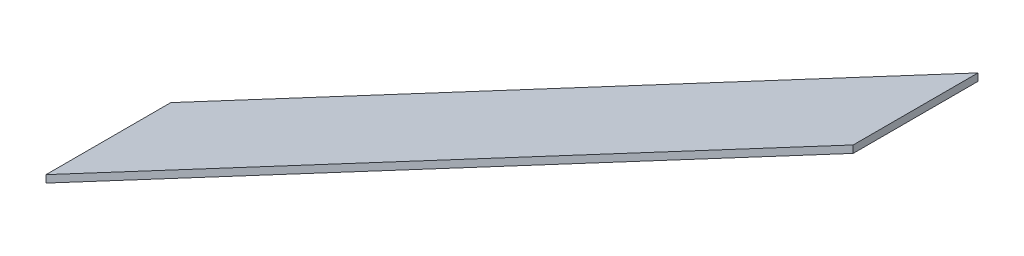
ISO-10303-21;
HEADER;
FILE_DESCRIPTION(('STEP AP214'),'2;1');
FILE_NAME('part.step','',(''),(''),'','','');
FILE_SCHEMA(('AUTOMOTIVE_DESIGN { 1 0 10303 214 1 1 1 1 }'));
ENDSEC;
DATA;
#1=APPLICATION_CONTEXT('core data for automotive mechanical design processes');
#2=APPLICATION_PROTOCOL_DEFINITION('international standard','automotive_design',2000,#1);
#3=PRODUCT_CONTEXT('',#1,'mechanical');
#4=PRODUCT('Part','Part','',(#3));
#5=PRODUCT_RELATED_PRODUCT_CATEGORY('part','',(#4));
#6=PRODUCT_DEFINITION_FORMATION('','',#4);
#7=PRODUCT_DEFINITION_CONTEXT('part definition',#1,'design');
#8=PRODUCT_DEFINITION('design','',#6,#7);
#9=PRODUCT_DEFINITION_SHAPE('','',#8);
#10=(LENGTH_UNIT() NAMED_UNIT(*) SI_UNIT(.MILLI.,.METRE.));
#11=(NAMED_UNIT(*) PLANE_ANGLE_UNIT() SI_UNIT($,.RADIAN.));
#12=(NAMED_UNIT(*) SI_UNIT($,.STERADIAN.) SOLID_ANGLE_UNIT());
#13=UNCERTAINTY_MEASURE_WITH_UNIT(LENGTH_MEASURE(1.E-05),#10,'distance_accuracy_value','');
#14=(GEOMETRIC_REPRESENTATION_CONTEXT(3) GLOBAL_UNCERTAINTY_ASSIGNED_CONTEXT((#13)) GLOBAL_UNIT_ASSIGNED_CONTEXT((#10,
#11,#12)) REPRESENTATION_CONTEXT('',''));
#15=CARTESIAN_POINT('',(0.,0.,0.));
#16=DIRECTION('',(0.,0.,1.));
#17=DIRECTION('',(1.,0.,0.));
#18=AXIS2_PLACEMENT_3D('',#15,#16,#17);
#19=CARTESIAN_POINT('',(-1000.,-49.9999999999998,-850.000000000001));
#20=DIRECTION('',(1.,0.,0.));
#21=DIRECTION('',(0.,0.,-1.));
#22=AXIS2_PLACEMENT_3D('',#19,#20,#21);
#23=PLANE('',#22);
#24=DIRECTION('',(0.,1.,0.));
#25=VECTOR('',#24,1.);
#26=CARTESIAN_POINT('',(-1000.,-49.9999999999998,0.));
#27=LINE('',#26,#25);
#28=CARTESIAN_POINT('',(-1000.,-49.9999999999998,0.));
#29=VERTEX_POINT('',#28);
#30=CARTESIAN_POINT('',(-1000.,0.,0.));
#31=VERTEX_POINT('',#30);
#32=EDGE_CURVE('E94',#29,#31,#27,.T.);
#33=ORIENTED_EDGE('',*,*,#32,.F.);
#34=DIRECTION('',(0.,0.,1.));
#35=VECTOR('',#34,1.);
#36=CARTESIAN_POINT('',(-1000.,-49.9999999999998,-850.000000000001));
#37=LINE('',#36,#35);
#38=CARTESIAN_POINT('',(-1000.,-49.9999999999998,-850.000000000001));
#39=VERTEX_POINT('',#38);
#40=EDGE_CURVE('E11',#39,#29,#37,.T.);
#41=ORIENTED_EDGE('',*,*,#40,.F.);
#42=DIRECTION('',(0.,1.,0.));
#43=VECTOR('',#42,1.);
#44=CARTESIAN_POINT('',(-1000.,-49.9999999999998,-850.000000000001));
#45=LINE('',#44,#43);
#46=CARTESIAN_POINT('',(-1000.,0.,-850.000000000001));
#47=VERTEX_POINT('',#46);
#48=EDGE_CURVE('E88',#39,#47,#45,.T.);
#49=ORIENTED_EDGE('',*,*,#48,.T.);
#50=DIRECTION('',(0.,0.,1.));
#51=VECTOR('',#50,1.);
#52=CARTESIAN_POINT('',(-1000.,0.,-850.000000000001));
#53=LINE('',#52,#51);
#54=EDGE_CURVE('E33',#47,#31,#53,.T.);
#55=ORIENTED_EDGE('',*,*,#54,.T.);
#56=EDGE_LOOP('',(#33,#41,#49,#55));
#57=FACE_BOUND('',#56,.T.);
#58=ADVANCED_FACE('F30',(#57),#23,.T.);
#59=CARTESIAN_POINT('',(-1000.,-49.9999999999998,-850.000000000001));
#60=DIRECTION('',(0.469583150901357,-0.88288825136002,0.));
#61=DIRECTION('',(0.88288825136002,0.469583150901357,0.));
#62=AXIS2_PLACEMENT_3D('',#59,#60,#61);
#63=PLANE('',#62);
#64=DIRECTION('',(0.88288825136002,0.469583150901357,0.));
#65=VECTOR('',#64,1.);
#66=CARTESIAN_POINT('',(-1000.,-49.9999999999998,0.));
#67=LINE('',#66,#65);
#68=CARTESIAN_POINT('',(-6499.44803230502,-2975.,-3.5527136788005E-12));
#69=VERTEX_POINT('',#68);
#70=EDGE_CURVE('E90',#69,#29,#67,.T.);
#71=ORIENTED_EDGE('',*,*,#70,.F.);
#72=DIRECTION('',(0.,0.,1.));
#73=VECTOR('',#72,1.);
#74=CARTESIAN_POINT('',(-6499.44803230502,-2975.,-849.999999999998));
#75=LINE('',#74,#73);
#76=CARTESIAN_POINT('',(-6499.44803230502,-2975.,-849.999999999998));
#77=VERTEX_POINT('',#76);
#78=EDGE_CURVE('E39',#77,#69,#75,.T.);
#79=ORIENTED_EDGE('',*,*,#78,.F.);
#80=DIRECTION('',(0.88288825136002,0.469583150901357,0.));
#81=VECTOR('',#80,1.);
#82=CARTESIAN_POINT('',(-1000.,-49.9999999999998,-850.000000000001));
#83=LINE('',#82,#81);
#84=EDGE_CURVE('E85',#77,#39,#83,.T.);
#85=ORIENTED_EDGE('',*,*,#84,.T.);
#86=ORIENTED_EDGE('',*,*,#40,.T.);
#87=EDGE_LOOP('',(#71,#79,#85,#86));
#88=FACE_BOUND('',#87,.T.);
#89=ADVANCED_FACE('F104',(#88),#63,.T.);
#90=CARTESIAN_POINT('',(-6499.44803230502,-2925.,-849.999999999998));
#91=DIRECTION('',(-1.,0.,0.));
#92=DIRECTION('',(0.,0.,1.));
#93=AXIS2_PLACEMENT_3D('',#90,#91,#92);
#94=PLANE('',#93);
#95=DIRECTION('',(0.,-1.,0.));
#96=VECTOR('',#95,1.);
#97=CARTESIAN_POINT('',(-6499.44803230502,-2925.,-3.5527136788005E-12));
#98=LINE('',#97,#96);
#99=CARTESIAN_POINT('',(-6499.44803230502,-2925.,-3.5527136788005E-12));
#100=VERTEX_POINT('',#99);
#101=EDGE_CURVE('E80',#100,#69,#98,.T.);
#102=ORIENTED_EDGE('',*,*,#101,.F.);
#103=DIRECTION('',(0.,0.,1.));
#104=VECTOR('',#103,1.);
#105=CARTESIAN_POINT('',(-6499.44803230502,-2925.,-849.999999999998));
#106=LINE('',#105,#104);
#107=CARTESIAN_POINT('',(-6499.44803230502,-2925.,-849.999999999998));
#108=VERTEX_POINT('',#107);
#109=EDGE_CURVE('E75',#108,#100,#106,.T.);
#110=ORIENTED_EDGE('',*,*,#109,.F.);
#111=DIRECTION('',(0.,-1.,0.));
#112=VECTOR('',#111,1.);
#113=CARTESIAN_POINT('',(-6499.44803230502,-2925.,-849.999999999998));
#114=LINE('',#113,#112);
#115=EDGE_CURVE('E78',#108,#77,#114,.T.);
#116=ORIENTED_EDGE('',*,*,#115,.T.);
#117=ORIENTED_EDGE('',*,*,#78,.T.);
#118=EDGE_LOOP('',(#102,#110,#116,#117));
#119=FACE_BOUND('',#118,.T.);
#120=ADVANCED_FACE('F77',(#119),#94,.T.);
#121=CARTESIAN_POINT('',(-1000.,0.,-850.000000000001));
#122=DIRECTION('',(-0.469583150901357,0.88288825136002,0.));
#123=DIRECTION('',(-0.88288825136002,-0.469583150901357,0.));
#124=AXIS2_PLACEMENT_3D('',#121,#122,#123);
#125=PLANE('',#124);
#126=DIRECTION('',(-0.88288825136002,-0.469583150901357,0.));
#127=VECTOR('',#126,1.);
#128=CARTESIAN_POINT('',(-1000.,0.,0.));
#129=LINE('',#128,#127);
#130=EDGE_CURVE('E97',#31,#100,#129,.T.);
#131=ORIENTED_EDGE('',*,*,#130,.F.);
#132=ORIENTED_EDGE('',*,*,#54,.F.);
#133=DIRECTION('',(-0.88288825136002,-0.469583150901357,0.));
#134=VECTOR('',#133,1.);
#135=CARTESIAN_POINT('',(-1000.,0.,-850.000000000001));
#136=LINE('',#135,#134);
#137=EDGE_CURVE('E84',#47,#108,#136,.T.);
#138=ORIENTED_EDGE('',*,*,#137,.T.);
#139=ORIENTED_EDGE('',*,*,#109,.T.);
#140=EDGE_LOOP('',(#131,#132,#138,#139));
#141=FACE_BOUND('',#140,.T.);
#142=ADVANCED_FACE('F87',(#141),#125,.T.);
#143=CARTESIAN_POINT('',(-1000.,0.,-850.000000000001));
#144=DIRECTION('',(0.,0.,1.));
#145=DIRECTION('',(1.,0.,0.));
#146=AXIS2_PLACEMENT_3D('',#143,#144,#145);
#147=PLANE('',#146);
#148=ORIENTED_EDGE('',*,*,#48,.F.);
#149=ORIENTED_EDGE('',*,*,#84,.F.);
#150=ORIENTED_EDGE('',*,*,#115,.F.);
#151=ORIENTED_EDGE('',*,*,#137,.F.);
#152=EDGE_LOOP('',(#148,#149,#150,#151));
#153=FACE_BOUND('',#152,.T.);
#154=ADVANCED_FACE('F83',(#153),#147,.F.);
#155=CARTESIAN_POINT('',(-1000.,0.,0.));
#156=DIRECTION('',(0.,0.,1.));
#157=DIRECTION('',(1.,0.,0.));
#158=AXIS2_PLACEMENT_3D('',#155,#156,#157);
#159=PLANE('',#158);
#160=ORIENTED_EDGE('',*,*,#32,.T.);
#161=ORIENTED_EDGE('',*,*,#130,.T.);
#162=ORIENTED_EDGE('',*,*,#101,.T.);
#163=ORIENTED_EDGE('',*,*,#70,.T.);
#164=EDGE_LOOP('',(#160,#161,#162,#163));
#165=FACE_BOUND('',#164,.T.);
#166=ADVANCED_FACE('F103',(#165),#159,.T.);
#167=CLOSED_SHELL('',(#58,#89,#120,#142,#154,#166));
#168=MANIFOLD_SOLID_BREP('B2',#167);
#169=ADVANCED_BREP_SHAPE_REPRESENTATION('',(#18,#168),#14);
#170=SHAPE_DEFINITION_REPRESENTATION(#9,#169);
ENDSEC;
END-ISO-10303-21;
